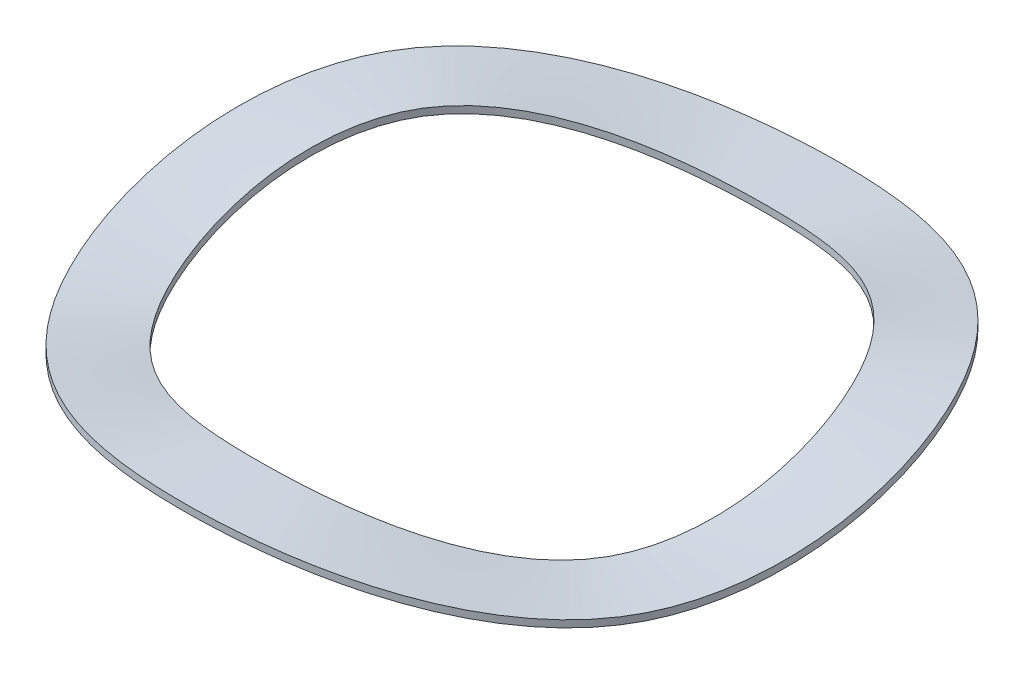
ISO-10303-21;
HEADER;
FILE_DESCRIPTION(('STEP AP214'),'2;1');
FILE_NAME('part.step','',(''),(''),'','','');
FILE_SCHEMA(('AUTOMOTIVE_DESIGN { 1 0 10303 214 1 1 1 1 }'));
ENDSEC;
DATA;
#1=APPLICATION_CONTEXT('core data for automotive mechanical design processes');
#2=APPLICATION_PROTOCOL_DEFINITION('international standard','automotive_design',2000,#1);
#3=PRODUCT_CONTEXT('',#1,'mechanical');
#4=PRODUCT('Part','Part','',(#3));
#5=PRODUCT_RELATED_PRODUCT_CATEGORY('part','',(#4));
#6=PRODUCT_DEFINITION_FORMATION('','',#4);
#7=PRODUCT_DEFINITION_CONTEXT('part definition',#1,'design');
#8=PRODUCT_DEFINITION('design','',#6,#7);
#9=PRODUCT_DEFINITION_SHAPE('','',#8);
#10=(LENGTH_UNIT() NAMED_UNIT(*) SI_UNIT(.MILLI.,.METRE.));
#11=(NAMED_UNIT(*) PLANE_ANGLE_UNIT() SI_UNIT($,.RADIAN.));
#12=(NAMED_UNIT(*) SI_UNIT($,.STERADIAN.) SOLID_ANGLE_UNIT());
#13=UNCERTAINTY_MEASURE_WITH_UNIT(LENGTH_MEASURE(1.E-05),#10,'distance_accuracy_value','');
#14=(GEOMETRIC_REPRESENTATION_CONTEXT(3) GLOBAL_UNCERTAINTY_ASSIGNED_CONTEXT((#13)) GLOBAL_UNIT_ASSIGNED_CONTEXT((#10,
#11,#12)) REPRESENTATION_CONTEXT('',''));
#15=CARTESIAN_POINT('',(0.,0.,0.));
#16=DIRECTION('',(0.,0.,1.));
#17=DIRECTION('',(1.,0.,0.));
#18=AXIS2_PLACEMENT_3D('',#15,#16,#17);
#19=CARTESIAN_POINT('',(0.,0.292099999999999,-13.716));
#20=CARTESIAN_POINT('',(4.75136177532294,0.292099999999999,-13.716));
#21=CARTESIAN_POINT('',(14.2540853259689,3.4163,-8.2296));
#22=CARTESIAN_POINT('',(14.2540853259688,-1.27,8.22960000000003));
#23=CARTESIAN_POINT('',(0.,3.4163,16.4592));
#24=CARTESIAN_POINT('',(-14.2540853259689,-1.27,8.22959999999994));
#25=CARTESIAN_POINT('',(-14.2540853259688,1.8542,-2.74320000000006));
#26=CARTESIAN_POINT('',(-9.50272355064585,1.8542,-10.9728));
#27=CARTESIAN_POINT('',(-4.75136177532293,0.2921,-13.716));
#28=CARTESIAN_POINT('',(0.,0.292099999999999,-13.716));
#29=CARTESIAN_POINT('',(0.,0.292099999999999,-12.6957666666667));
#30=CARTESIAN_POINT('',(4.3979425815412,0.292099999999999,-12.6957666666667));
#31=CARTESIAN_POINT('',(13.1938277446236,3.4163,-7.61746));
#32=CARTESIAN_POINT('',(13.1938277446236,-1.27,7.61746000000003));
#33=CARTESIAN_POINT('',(0.,3.4163,15.23492));
#34=CARTESIAN_POINT('',(-13.1938277446237,-1.27,7.61745999999995));
#35=CARTESIAN_POINT('',(-13.1938277446236,1.8542,-2.53915333333339));
#36=CARTESIAN_POINT('',(-8.79588516308238,1.8542,-10.1566133333334));
#37=CARTESIAN_POINT('',(-4.3979425815412,0.2921,-12.6957666666667));
#38=CARTESIAN_POINT('',(0.,0.292099999999999,-12.6957666666667));
#39=CARTESIAN_POINT('',(0.,0.292099999999999,-11.6755333333333));
#40=CARTESIAN_POINT('',(4.04452338775947,0.292099999999998,-11.6755333333333));
#41=CARTESIAN_POINT('',(12.1335701632784,3.4163,-7.00532));
#42=CARTESIAN_POINT('',(12.1335701632784,-1.27,7.00532000000003));
#43=CARTESIAN_POINT('',(0.,3.4163,14.01064));
#44=CARTESIAN_POINT('',(-12.1335701632785,-1.27000000000001,7.00531999999996));
#45=CARTESIAN_POINT('',(-12.1335701632784,1.8542,-2.33510666666672));
#46=CARTESIAN_POINT('',(-8.08904677551891,1.8542,-9.34042666666671));
#47=CARTESIAN_POINT('',(-4.04452338775946,0.2921,-11.6755333333333));
#48=CARTESIAN_POINT('',(0.,0.292099999999999,-11.6755333333333));
#49=CARTESIAN_POINT('',(0.,0.292099999999999,-10.6553));
#50=CARTESIAN_POINT('',(3.69110419397773,0.292099999999999,-10.6553));
#51=CARTESIAN_POINT('',(11.0733125819332,3.4163,-6.39318));
#52=CARTESIAN_POINT('',(11.0733125819332,-1.27,6.39318000000003));
#53=CARTESIAN_POINT('',(0.,3.4163,12.78636));
#54=CARTESIAN_POINT('',(-11.0733125819332,-1.27000000000001,6.39317999999997));
#55=CARTESIAN_POINT('',(-11.0733125819332,1.8542,-2.13106000000005));
#56=CARTESIAN_POINT('',(-7.38220838795543,1.8542,-8.52424000000004));
#57=CARTESIAN_POINT('',(-3.69110419397772,0.2921,-10.6553));
#58=CARTESIAN_POINT('',(0.,0.292099999999999,-10.6553));
#59=B_SPLINE_SURFACE_WITH_KNOTS('',3,3,((#19,#20,#21,#22,#23,#24,#25,#26,#27,#28),(#29,#30,#31,
#32,#33,#34,#35,#36,#37,#38),(#39,#40,#41,#42,#43,#44,#45,#46,#47,#48),(#49,#50,#51,#52,#53,#54,
#55,#56,#57,#58)),.UNSPECIFIED.,.F.,.T.,.F.,(4,4),(4,1,1,1,1,2,4),(0.,1.),(0.,0.166666666666667,
0.333333333333334,0.5,0.666666666666666,0.833333333333333,1.),.UNSPECIFIED.);
#60=CARTESIAN_POINT('',(0.,0.292099999999999,-13.716));
#61=CARTESIAN_POINT('',(4.75136177532294,0.292099999999999,-13.716));
#62=CARTESIAN_POINT('',(14.2540853259689,3.4163,-8.2296));
#63=CARTESIAN_POINT('',(14.2540853259688,-1.27,8.22960000000003));
#64=CARTESIAN_POINT('',(0.,3.4163,16.4592));
#65=CARTESIAN_POINT('',(-14.2540853259689,-1.27,8.22959999999994));
#66=CARTESIAN_POINT('',(-14.2540853259688,1.8542,-2.74320000000006));
#67=CARTESIAN_POINT('',(-9.50272355064585,1.8542,-10.9728));
#68=CARTESIAN_POINT('',(-4.75136177532293,0.2921,-13.716));
#69=CARTESIAN_POINT('',(0.,0.292099999999999,-13.716));
#70=B_SPLINE_CURVE_WITH_KNOTS('',3,(#60,#61,#62,#63,#64,#65,#66,#67,#68,#69),.UNSPECIFIED.,.T.,
.F.,(4,1,1,1,1,2,4),(0.,0.166666666666667,0.333333333333334,0.5,0.666666666666666,
0.833333333333333,1.),.UNSPECIFIED.);
#71=CARTESIAN_POINT('',(0.,0.292099999999999,-13.716));
#72=VERTEX_POINT('',#71);
#73=EDGE_CURVE('E32',#72,#72,#70,.T.);
#74=CARTESIAN_POINT('',(0.,0.292099999999999,-10.6553));
#75=CARTESIAN_POINT('',(3.69110419397773,0.292099999999999,-10.6553));
#76=CARTESIAN_POINT('',(11.0733125819332,3.4163,-6.39318));
#77=CARTESIAN_POINT('',(11.0733125819332,-1.27,6.39318000000003));
#78=CARTESIAN_POINT('',(0.,3.4163,12.78636));
#79=CARTESIAN_POINT('',(-11.0733125819332,-1.27000000000001,6.39317999999996));
#80=CARTESIAN_POINT('',(-11.0733125819332,1.8542,-2.13106000000005));
#81=CARTESIAN_POINT('',(-7.38220838795543,1.8542,-8.52424000000004));
#82=CARTESIAN_POINT('',(-3.69110419397772,0.2921,-10.6553));
#83=CARTESIAN_POINT('',(0.,0.292099999999999,-10.6553));
#84=B_SPLINE_CURVE_WITH_KNOTS('',3,(#74,#75,#76,#77,#78,#79,#80,#81,#82,#83),.UNSPECIFIED.,.T.,
.F.,(4,1,1,1,1,2,4),(0.,0.166666666666667,0.333333333333334,0.5,0.666666666666666,
0.833333333333333,1.),.UNSPECIFIED.);
#85=CARTESIAN_POINT('',(0.,0.292099999999999,-10.6553));
#86=VERTEX_POINT('',#85);
#87=EDGE_CURVE('E21',#86,#86,#84,.F.);
#88=ORIENTED_EDGE('',*,*,#73,.F.);
#89=EDGE_LOOP('',(#88));
#90=FACE_BOUND('',#89,.T.);
#91=ORIENTED_EDGE('',*,*,#87,.F.);
#92=EDGE_LOOP('',(#91));
#93=FACE_BOUND('',#92,.T.);
#94=ADVANCED_FACE('F15',(#90,#93),#59,.T.);
#95=CARTESIAN_POINT('',(0.,0.292099999999999,-10.6553));
#96=CARTESIAN_POINT('',(3.69110419397773,0.292099999999999,-10.6553));
#97=CARTESIAN_POINT('',(11.0733125819332,3.4163,-6.39318));
#98=CARTESIAN_POINT('',(11.0733125819332,-1.27,6.39318000000003));
#99=CARTESIAN_POINT('',(0.,3.4163,12.78636));
#100=CARTESIAN_POINT('',(-11.0733125819332,-1.27000000000001,6.39317999999996));
#101=CARTESIAN_POINT('',(-11.0733125819332,1.8542,-2.13106000000005));
#102=CARTESIAN_POINT('',(-7.38220838795543,1.8542,-8.52424000000004));
#103=CARTESIAN_POINT('',(-3.69110419397772,0.2921,-10.6553));
#104=CARTESIAN_POINT('',(0.,0.292099999999999,-10.6553));
#105=CARTESIAN_POINT('',(0.,0.194733333333333,-10.6553));
#106=CARTESIAN_POINT('',(3.69110419397773,0.194733333333332,-10.6553));
#107=CARTESIAN_POINT('',(11.0733125819332,3.31893333333334,-6.39318));
#108=CARTESIAN_POINT('',(11.0733125819332,-1.36736666666667,6.39318000000003));
#109=CARTESIAN_POINT('',(0.,3.31893333333333,12.78636));
#110=CARTESIAN_POINT('',(-11.0733125819332,-1.36736666666667,6.39317999999996));
#111=CARTESIAN_POINT('',(-11.0733125819332,1.75683333333333,-2.13106000000005));
#112=CARTESIAN_POINT('',(-7.38220838795543,1.75683333333334,-8.52424000000004));
#113=CARTESIAN_POINT('',(-3.69110419397772,0.194733333333333,-10.6553));
#114=CARTESIAN_POINT('',(0.,0.194733333333333,-10.6553));
#115=CARTESIAN_POINT('',(0.,0.0973666666666658,-10.6553));
#116=CARTESIAN_POINT('',(3.69110419397773,0.0973666666666655,-10.6553));
#117=CARTESIAN_POINT('',(11.0733125819332,3.22156666666667,-6.39318));
#118=CARTESIAN_POINT('',(11.0733125819332,-1.46473333333333,6.39318000000003));
#119=CARTESIAN_POINT('',(0.,3.22156666666666,12.78636));
#120=CARTESIAN_POINT('',(-11.0733125819332,-1.46473333333333,6.39317999999996));
#121=CARTESIAN_POINT('',(-11.0733125819332,1.65946666666666,-2.13106000000005));
#122=CARTESIAN_POINT('',(-7.38220838795543,1.65946666666667,-8.52424000000004));
#123=CARTESIAN_POINT('',(-3.69110419397772,0.0973666666666661,-10.6553));
#124=CARTESIAN_POINT('',(0.,0.0973666666666658,-10.6553));
#125=CARTESIAN_POINT('',(0.,0.,-10.6553));
#126=CARTESIAN_POINT('',(3.69110419397773,0.,-10.6553));
#127=CARTESIAN_POINT('',(11.0733125819332,3.1242,-6.39318));
#128=CARTESIAN_POINT('',(11.0733125819332,-1.5621,6.39318000000003));
#129=CARTESIAN_POINT('',(0.,3.12419999999999,12.78636));
#130=CARTESIAN_POINT('',(-11.0733125819332,-1.5621,6.39317999999996));
#131=CARTESIAN_POINT('',(-11.0733125819332,1.5621,-2.13106000000005));
#132=CARTESIAN_POINT('',(-7.38220838795543,1.5621,-8.52424000000004));
#133=CARTESIAN_POINT('',(-3.69110419397772,0.,-10.6553));
#134=CARTESIAN_POINT('',(0.,0.,-10.6553));
#135=B_SPLINE_SURFACE_WITH_KNOTS('',3,3,((#95,#96,#97,#98,#99,#100,#101,#102,#103,#104),(#105,
#106,#107,#108,#109,#110,#111,#112,#113,#114),(#115,#116,#117,#118,#119,#120,#121,#122,#123,
#124),(#125,#126,#127,#128,#129,#130,#131,#132,#133,#134)),.UNSPECIFIED.,.F.,.T.,.F.,(4,4),(4,1,
1,1,1,2,4),(0.,1.),(0.,0.166666666666667,0.333333333333334,0.5,0.666666666666666,
0.833333333333333,1.),.UNSPECIFIED.);
#136=CARTESIAN_POINT('',(0.,0.,-10.6553));
#137=CARTESIAN_POINT('',(3.69110419397773,0.,-10.6553));
#138=CARTESIAN_POINT('',(11.0733125819332,3.1242,-6.39318));
#139=CARTESIAN_POINT('',(11.0733125819332,-1.5621,6.39318000000003));
#140=CARTESIAN_POINT('',(0.,3.12419999999999,12.78636));
#141=CARTESIAN_POINT('',(-11.0733125819332,-1.5621,6.39317999999996));
#142=CARTESIAN_POINT('',(-11.0733125819332,1.5621,-2.13106000000005));
#143=CARTESIAN_POINT('',(-7.38220838795543,1.5621,-8.52424000000004));
#144=CARTESIAN_POINT('',(-3.69110419397772,0.,-10.6553));
#145=CARTESIAN_POINT('',(0.,0.,-10.6553));
#146=B_SPLINE_CURVE_WITH_KNOTS('',3,(#136,#137,#138,#139,#140,#141,#142,#143,#144,#145),
.UNSPECIFIED.,.T.,.F.,(4,1,1,1,1,2,4),(0.,0.166666666666667,0.333333333333334,0.5,
0.666666666666666,0.833333333333333,1.),.UNSPECIFIED.);
#147=CARTESIAN_POINT('',(0.,0.,-10.6553));
#148=VERTEX_POINT('',#147);
#149=EDGE_CURVE('E27',#148,#148,#146,.F.);
#150=ORIENTED_EDGE('',*,*,#87,.T.);
#151=EDGE_LOOP('',(#150));
#152=FACE_BOUND('',#151,.T.);
#153=ORIENTED_EDGE('',*,*,#149,.F.);
#154=EDGE_LOOP('',(#153));
#155=FACE_BOUND('',#154,.T.);
#156=ADVANCED_FACE('F55',(#152,#155),#135,.T.);
#157=CARTESIAN_POINT('',(0.,0.,-13.716));
#158=CARTESIAN_POINT('',(4.75136177532294,0.,-13.716));
#159=CARTESIAN_POINT('',(14.2540853259689,3.1242,-8.2296));
#160=CARTESIAN_POINT('',(14.2540853259688,-1.5621,8.22960000000003));
#161=CARTESIAN_POINT('',(0.,3.1242,16.4592));
#162=CARTESIAN_POINT('',(-14.2540853259689,-1.5621,8.22959999999994));
#163=CARTESIAN_POINT('',(-14.2540853259688,1.5621,-2.74320000000006));
#164=CARTESIAN_POINT('',(-9.50272355064585,1.5621,-10.9728));
#165=CARTESIAN_POINT('',(-4.75136177532293,0.,-13.716));
#166=CARTESIAN_POINT('',(0.,0.,-13.716));
#167=CARTESIAN_POINT('',(0.,0.0973666666666665,-13.716));
#168=CARTESIAN_POINT('',(4.75136177532294,0.0973666666666662,-13.716));
#169=CARTESIAN_POINT('',(14.2540853259689,3.22156666666667,-8.2296));
#170=CARTESIAN_POINT('',(14.2540853259688,-1.46473333333333,8.22960000000003));
#171=CARTESIAN_POINT('',(0.,3.22156666666666,16.4592));
#172=CARTESIAN_POINT('',(-14.2540853259689,-1.46473333333333,8.22959999999994));
#173=CARTESIAN_POINT('',(-14.2540853259688,1.65946666666666,-2.74320000000006));
#174=CARTESIAN_POINT('',(-9.50272355064585,1.65946666666667,-10.9728));
#175=CARTESIAN_POINT('',(-4.75136177532293,0.0973666666666667,-13.716));
#176=CARTESIAN_POINT('',(0.,0.0973666666666665,-13.716));
#177=CARTESIAN_POINT('',(0.,0.194733333333333,-13.716));
#178=CARTESIAN_POINT('',(4.75136177532294,0.194733333333333,-13.716));
#179=CARTESIAN_POINT('',(14.2540853259689,3.31893333333333,-8.2296));
#180=CARTESIAN_POINT('',(14.2540853259688,-1.36736666666666,8.22960000000003));
#181=CARTESIAN_POINT('',(0.,3.31893333333333,16.4592));
#182=CARTESIAN_POINT('',(-14.2540853259689,-1.36736666666667,8.22959999999994));
#183=CARTESIAN_POINT('',(-14.2540853259688,1.75683333333333,-2.74320000000006));
#184=CARTESIAN_POINT('',(-9.50272355064585,1.75683333333334,-10.9728));
#185=CARTESIAN_POINT('',(-4.75136177532293,0.194733333333333,-13.716));
#186=CARTESIAN_POINT('',(0.,0.194733333333333,-13.716));
#187=CARTESIAN_POINT('',(0.,0.292099999999999,-13.716));
#188=CARTESIAN_POINT('',(4.75136177532294,0.292099999999999,-13.716));
#189=CARTESIAN_POINT('',(14.2540853259689,3.4163,-8.2296));
#190=CARTESIAN_POINT('',(14.2540853259688,-1.27,8.22960000000003));
#191=CARTESIAN_POINT('',(0.,3.4163,16.4592));
#192=CARTESIAN_POINT('',(-14.2540853259689,-1.27,8.22959999999994));
#193=CARTESIAN_POINT('',(-14.2540853259688,1.8542,-2.74320000000006));
#194=CARTESIAN_POINT('',(-9.50272355064585,1.8542,-10.9728));
#195=CARTESIAN_POINT('',(-4.75136177532293,0.2921,-13.716));
#196=CARTESIAN_POINT('',(0.,0.292099999999999,-13.716));
#197=B_SPLINE_SURFACE_WITH_KNOTS('',3,3,((#157,#158,#159,#160,#161,#162,#163,#164,#165,#166),
(#167,#168,#169,#170,#171,#172,#173,#174,#175,#176),(#177,#178,#179,#180,#181,#182,#183,#184,
#185,#186),(#187,#188,#189,#190,#191,#192,#193,#194,#195,#196)),.UNSPECIFIED.,.F.,.T.,.F.,(4,4),
(4,1,1,1,1,2,4),(0.,1.),(0.,0.166666666666667,0.333333333333334,0.5,0.666666666666666,
0.833333333333333,1.),.UNSPECIFIED.);
#198=CARTESIAN_POINT('',(0.,0.,-13.716));
#199=CARTESIAN_POINT('',(4.75136177532294,0.,-13.716));
#200=CARTESIAN_POINT('',(14.2540853259689,3.1242,-8.2296));
#201=CARTESIAN_POINT('',(14.2540853259688,-1.5621,8.22960000000003));
#202=CARTESIAN_POINT('',(0.,3.1242,16.4592));
#203=CARTESIAN_POINT('',(-14.2540853259689,-1.5621,8.22959999999994));
#204=CARTESIAN_POINT('',(-14.2540853259688,1.5621,-2.74320000000006));
#205=CARTESIAN_POINT('',(-9.50272355064585,1.5621,-10.9728));
#206=CARTESIAN_POINT('',(-4.75136177532293,0.,-13.716));
#207=CARTESIAN_POINT('',(0.,0.,-13.716));
#208=B_SPLINE_CURVE_WITH_KNOTS('',3,(#198,#199,#200,#201,#202,#203,#204,#205,#206,#207),
.UNSPECIFIED.,.T.,.F.,(4,1,1,1,1,2,4),(0.,0.166666666666667,0.333333333333334,0.5,
0.666666666666666,0.833333333333333,1.),.UNSPECIFIED.);
#209=CARTESIAN_POINT('',(0.,0.,-13.716));
#210=VERTEX_POINT('',#209);
#211=EDGE_CURVE('E10',#210,#210,#208,.T.);
#212=ORIENTED_EDGE('',*,*,#73,.T.);
#213=EDGE_LOOP('',(#212));
#214=FACE_BOUND('',#213,.T.);
#215=ORIENTED_EDGE('',*,*,#211,.F.);
#216=EDGE_LOOP('',(#215));
#217=FACE_BOUND('',#216,.T.);
#218=ADVANCED_FACE('F65',(#214,#217),#197,.T.);
#219=CARTESIAN_POINT('',(0.,0.,-10.6553));
#220=CARTESIAN_POINT('',(3.69110419397773,0.,-10.6553));
#221=CARTESIAN_POINT('',(11.0733125819332,3.1242,-6.39318));
#222=CARTESIAN_POINT('',(11.0733125819332,-1.5621,6.39318000000003));
#223=CARTESIAN_POINT('',(0.,3.12419999999999,12.78636));
#224=CARTESIAN_POINT('',(-11.0733125819332,-1.5621,6.39317999999996));
#225=CARTESIAN_POINT('',(-11.0733125819332,1.5621,-2.13106000000005));
#226=CARTESIAN_POINT('',(-7.38220838795543,1.5621,-8.52424000000004));
#227=CARTESIAN_POINT('',(-3.69110419397772,0.,-10.6553));
#228=CARTESIAN_POINT('',(0.,0.,-10.6553));
#229=CARTESIAN_POINT('',(0.,0.,-11.6755333333333));
#230=CARTESIAN_POINT('',(4.04452338775946,0.,-11.6755333333333));
#231=CARTESIAN_POINT('',(12.1335701632784,3.1242,-7.00532));
#232=CARTESIAN_POINT('',(12.1335701632784,-1.5621,7.00532000000003));
#233=CARTESIAN_POINT('',(0.,3.1242,14.01064));
#234=CARTESIAN_POINT('',(-12.1335701632785,-1.5621,7.00531999999996));
#235=CARTESIAN_POINT('',(-12.1335701632784,1.5621,-2.33510666666672));
#236=CARTESIAN_POINT('',(-8.08904677551891,1.5621,-9.34042666666671));
#237=CARTESIAN_POINT('',(-4.04452338775946,0.,-11.6755333333333));
#238=CARTESIAN_POINT('',(0.,0.,-11.6755333333333));
#239=CARTESIAN_POINT('',(0.,0.,-12.6957666666667));
#240=CARTESIAN_POINT('',(4.3979425815412,0.,-12.6957666666667));
#241=CARTESIAN_POINT('',(13.1938277446236,3.1242,-7.61746));
#242=CARTESIAN_POINT('',(13.1938277446236,-1.5621,7.61746000000003));
#243=CARTESIAN_POINT('',(0.,3.1242,15.23492));
#244=CARTESIAN_POINT('',(-13.1938277446237,-1.5621,7.61745999999995));
#245=CARTESIAN_POINT('',(-13.1938277446236,1.5621,-2.53915333333339));
#246=CARTESIAN_POINT('',(-8.79588516308238,1.5621,-10.1566133333334));
#247=CARTESIAN_POINT('',(-4.3979425815412,0.,-12.6957666666667));
#248=CARTESIAN_POINT('',(0.,0.,-12.6957666666667));
#249=CARTESIAN_POINT('',(0.,0.,-13.716));
#250=CARTESIAN_POINT('',(4.75136177532294,0.,-13.716));
#251=CARTESIAN_POINT('',(14.2540853259689,3.1242,-8.2296));
#252=CARTESIAN_POINT('',(14.2540853259688,-1.5621,8.22960000000003));
#253=CARTESIAN_POINT('',(0.,3.1242,16.4592));
#254=CARTESIAN_POINT('',(-14.2540853259689,-1.5621,8.22959999999994));
#255=CARTESIAN_POINT('',(-14.2540853259688,1.5621,-2.74320000000006));
#256=CARTESIAN_POINT('',(-9.50272355064585,1.5621,-10.9728));
#257=CARTESIAN_POINT('',(-4.75136177532293,0.,-13.716));
#258=CARTESIAN_POINT('',(0.,0.,-13.716));
#259=B_SPLINE_SURFACE_WITH_KNOTS('',3,3,((#219,#220,#221,#222,#223,#224,#225,#226,#227,#228),
(#229,#230,#231,#232,#233,#234,#235,#236,#237,#238),(#239,#240,#241,#242,#243,#244,#245,#246,
#247,#248),(#249,#250,#251,#252,#253,#254,#255,#256,#257,#258)),.UNSPECIFIED.,.F.,.T.,.F.,(4,4),
(4,1,1,1,1,2,4),(0.,1.),(0.,0.166666666666667,0.333333333333334,0.5,0.666666666666666,
0.833333333333333,1.),.UNSPECIFIED.);
#260=ORIENTED_EDGE('',*,*,#149,.T.);
#261=EDGE_LOOP('',(#260));
#262=FACE_BOUND('',#261,.T.);
#263=ORIENTED_EDGE('',*,*,#211,.T.);
#264=EDGE_LOOP('',(#263));
#265=FACE_BOUND('',#264,.T.);
#266=ADVANCED_FACE('F17',(#262,#265),#259,.T.);
#267=CLOSED_SHELL('',(#94,#156,#218,#266));
#268=MANIFOLD_SOLID_BREP('B1',#267);
#269=ADVANCED_BREP_SHAPE_REPRESENTATION('',(#18,#268),#14);
#270=SHAPE_DEFINITION_REPRESENTATION(#9,#269);
ENDSEC;
END-ISO-10303-21;
